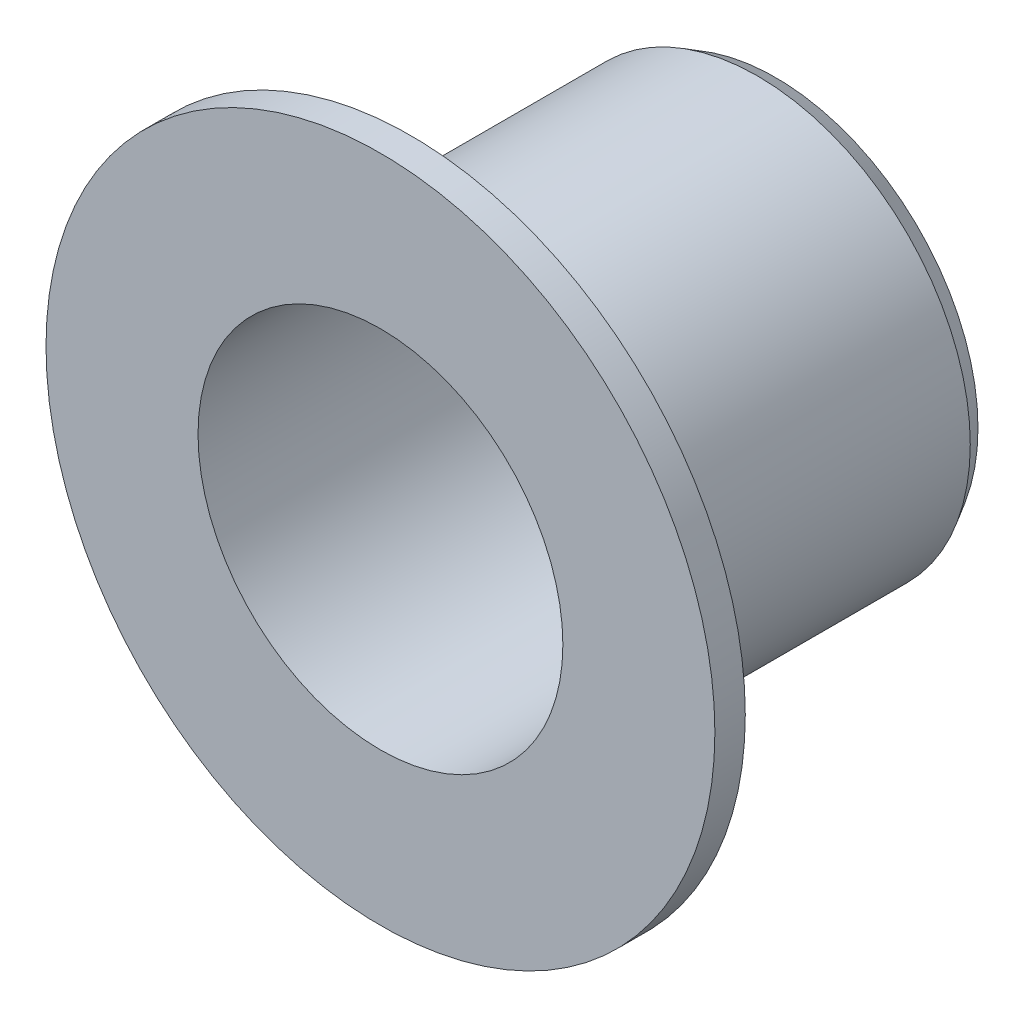
ISO-10303-21;
HEADER;
FILE_DESCRIPTION(('STEP AP214'),'2;1');
FILE_NAME('part.step','',(''),(''),'','','');
FILE_SCHEMA(('AUTOMOTIVE_DESIGN { 1 0 10303 214 1 1 1 1 }'));
ENDSEC;
DATA;
#1=APPLICATION_CONTEXT('core data for automotive mechanical design processes');
#2=APPLICATION_PROTOCOL_DEFINITION('international standard','automotive_design',2000,#1);
#3=PRODUCT_CONTEXT('',#1,'mechanical');
#4=PRODUCT('Part','Part','',(#3));
#5=PRODUCT_RELATED_PRODUCT_CATEGORY('part','',(#4));
#6=PRODUCT_DEFINITION_FORMATION('','',#4);
#7=PRODUCT_DEFINITION_CONTEXT('part definition',#1,'design');
#8=PRODUCT_DEFINITION('design','',#6,#7);
#9=PRODUCT_DEFINITION_SHAPE('','',#8);
#10=(LENGTH_UNIT() NAMED_UNIT(*) SI_UNIT(.MILLI.,.METRE.));
#11=(NAMED_UNIT(*) PLANE_ANGLE_UNIT() SI_UNIT($,.RADIAN.));
#12=(NAMED_UNIT(*) SI_UNIT($,.STERADIAN.) SOLID_ANGLE_UNIT());
#13=UNCERTAINTY_MEASURE_WITH_UNIT(LENGTH_MEASURE(1.E-05),#10,'distance_accuracy_value','');
#14=(GEOMETRIC_REPRESENTATION_CONTEXT(3) GLOBAL_UNCERTAINTY_ASSIGNED_CONTEXT((#13)) GLOBAL_UNIT_ASSIGNED_CONTEXT((#10,
#11,#12)) REPRESENTATION_CONTEXT('',''));
#15=CARTESIAN_POINT('',(0.,0.,0.));
#16=DIRECTION('',(0.,0.,1.));
#17=DIRECTION('',(1.,0.,0.));
#18=AXIS2_PLACEMENT_3D('',#15,#16,#17);
#19=CARTESIAN_POINT('',(0.,0.,5.5));
#20=DIRECTION('',(0.,0.,-1.));
#21=DIRECTION('',(-1.,0.,0.));
#22=AXIS2_PLACEMENT_3D('',#19,#20,#21);
#23=CYLINDRICAL_SURFACE('',#22,3.5);
#24=CARTESIAN_POINT('',(0.,0.,-0.199999999999997));
#25=DIRECTION('',(0.,0.,-1.));
#26=DIRECTION('',(-1.,0.,0.));
#27=AXIS2_PLACEMENT_3D('',#24,#25,#26);
#28=CIRCLE('',#27,3.5);
#29=CARTESIAN_POINT('',(-3.5,0.,-0.199999999999997));
#30=VERTEX_POINT('',#29);
#31=EDGE_CURVE('E10',#30,#30,#28,.F.);
#32=ORIENTED_EDGE('',*,*,#31,.T.);
#33=EDGE_LOOP('',(#32));
#34=FACE_BOUND('',#33,.T.);
#35=CARTESIAN_POINT('',(0.,0.,5.));
#36=DIRECTION('',(0.,0.,1.));
#37=DIRECTION('',(1.,0.,0.));
#38=AXIS2_PLACEMENT_3D('',#35,#36,#37);
#39=CIRCLE('',#38,3.5);
#40=CARTESIAN_POINT('',(3.5,0.,5.));
#41=VERTEX_POINT('',#40);
#42=EDGE_CURVE('E45',#41,#41,#39,.F.);
#43=ORIENTED_EDGE('',*,*,#42,.T.);
#44=EDGE_LOOP('',(#43));
#45=FACE_BOUND('',#44,.T.);
#46=ADVANCED_FACE('F33',(#34,#45),#23,.T.);
#47=CARTESIAN_POINT('',(0.,0.,5.5));
#48=DIRECTION('',(0.,0.,-1.));
#49=DIRECTION('',(-1.,0.,0.));
#50=AXIS2_PLACEMENT_3D('',#47,#48,#49);
#51=CYLINDRICAL_SURFACE('',#50,3.);
#52=CARTESIAN_POINT('',(0.,0.,-0.5));
#53=DIRECTION('',(0.,0.,-1.));
#54=DIRECTION('',(-1.,0.,0.));
#55=AXIS2_PLACEMENT_3D('',#52,#53,#54);
#56=CIRCLE('',#55,3.);
#57=CARTESIAN_POINT('',(-3.,0.,-0.5));
#58=VERTEX_POINT('',#57);
#59=EDGE_CURVE('E54',#58,#58,#56,.T.);
#60=ORIENTED_EDGE('',*,*,#59,.T.);
#61=EDGE_LOOP('',(#60));
#62=FACE_BOUND('',#61,.T.);
#63=CARTESIAN_POINT('',(0.,0.,6.));
#64=DIRECTION('',(0.,0.,1.));
#65=DIRECTION('',(1.,0.,0.));
#66=AXIS2_PLACEMENT_3D('',#63,#64,#65);
#67=CIRCLE('',#66,3.);
#68=CARTESIAN_POINT('',(3.,0.,6.));
#69=VERTEX_POINT('',#68);
#70=EDGE_CURVE('E61',#69,#69,#67,.T.);
#71=ORIENTED_EDGE('',*,*,#70,.T.);
#72=EDGE_LOOP('',(#71));
#73=FACE_BOUND('',#72,.T.);
#74=ADVANCED_FACE('F67',(#62,#73),#51,.F.);
#75=CARTESIAN_POINT('',(0.,0.,-0.5));
#76=DIRECTION('',(0.,0.,-1.));
#77=DIRECTION('',(-1.,0.,0.));
#78=AXIS2_PLACEMENT_3D('',#75,#76,#77);
#79=PLANE('',#78);
#80=CARTESIAN_POINT('',(0.,0.,-0.5));
#81=DIRECTION('',(0.,0.,-1.));
#82=DIRECTION('',(-1.,0.,0.));
#83=AXIS2_PLACEMENT_3D('',#80,#81,#82);
#84=CIRCLE('',#83,3.32679491924311);
#85=CARTESIAN_POINT('',(-3.32679491924311,0.,-0.5));
#86=VERTEX_POINT('',#85);
#87=EDGE_CURVE('E41',#86,#86,#84,.T.);
#88=ORIENTED_EDGE('',*,*,#87,.T.);
#89=EDGE_LOOP('',(#88));
#90=FACE_BOUND('',#89,.T.);
#91=ORIENTED_EDGE('',*,*,#59,.F.);
#92=EDGE_LOOP('',(#91));
#93=FACE_BOUND('',#92,.T.);
#94=ADVANCED_FACE('F72',(#90,#93),#79,.T.);
#95=CARTESIAN_POINT('',(0.,0.,6.));
#96=DIRECTION('',(0.,0.,1.));
#97=DIRECTION('',(1.,0.,0.));
#98=AXIS2_PLACEMENT_3D('',#95,#96,#97);
#99=PLANE('',#98);
#100=CARTESIAN_POINT('',(0.,0.,6.));
#101=DIRECTION('',(0.,0.,1.));
#102=DIRECTION('',(1.,0.,0.));
#103=AXIS2_PLACEMENT_3D('',#100,#101,#102);
#104=CIRCLE('',#103,5.5);
#105=CARTESIAN_POINT('',(5.5,0.,6.));
#106=VERTEX_POINT('',#105);
#107=EDGE_CURVE('E57',#106,#106,#104,.T.);
#108=ORIENTED_EDGE('',*,*,#107,.T.);
#109=EDGE_LOOP('',(#108));
#110=FACE_BOUND('',#109,.T.);
#111=ORIENTED_EDGE('',*,*,#70,.F.);
#112=EDGE_LOOP('',(#111));
#113=FACE_BOUND('',#112,.T.);
#114=ADVANCED_FACE('F69',(#110,#113),#99,.T.);
#115=CARTESIAN_POINT('',(0.,0.,5.5));
#116=DIRECTION('',(0.,0.,1.));
#117=DIRECTION('',(1.,0.,0.));
#118=AXIS2_PLACEMENT_3D('',#115,#116,#117);
#119=PLANE('',#118);
#120=CARTESIAN_POINT('',(0.,0.,5.5));
#121=DIRECTION('',(0.,0.,1.));
#122=DIRECTION('',(1.,0.,0.));
#123=AXIS2_PLACEMENT_3D('',#120,#121,#122);
#124=CIRCLE('',#123,4.);
#125=CARTESIAN_POINT('',(4.,0.,5.5));
#126=VERTEX_POINT('',#125);
#127=EDGE_CURVE('E49',#126,#126,#124,.T.);
#128=ORIENTED_EDGE('',*,*,#127,.T.);
#129=EDGE_LOOP('',(#128));
#130=FACE_BOUND('',#129,.T.);
#131=CARTESIAN_POINT('',(0.,0.,5.5));
#132=DIRECTION('',(0.,0.,1.));
#133=DIRECTION('',(1.,0.,0.));
#134=AXIS2_PLACEMENT_3D('',#131,#132,#133);
#135=CIRCLE('',#134,5.5);
#136=CARTESIAN_POINT('',(5.5,0.,5.5));
#137=VERTEX_POINT('',#136);
#138=EDGE_CURVE('E58',#137,#137,#135,.T.);
#139=ORIENTED_EDGE('',*,*,#138,.F.);
#140=EDGE_LOOP('',(#139));
#141=FACE_BOUND('',#140,.T.);
#142=ADVANCED_FACE('F71',(#130,#141),#119,.F.);
#143=CARTESIAN_POINT('',(0.,0.,6.));
#144=DIRECTION('',(0.,0.,-1.));
#145=DIRECTION('',(-1.,0.,0.));
#146=AXIS2_PLACEMENT_3D('',#143,#144,#145);
#147=CYLINDRICAL_SURFACE('',#146,5.5);
#148=ORIENTED_EDGE('',*,*,#107,.F.);
#149=EDGE_LOOP('',(#148));
#150=FACE_BOUND('',#149,.T.);
#151=ORIENTED_EDGE('',*,*,#138,.T.);
#152=EDGE_LOOP('',(#151));
#153=FACE_BOUND('',#152,.T.);
#154=ADVANCED_FACE('F79',(#150,#153),#147,.T.);
#155=CARTESIAN_POINT('',(0.,0.,5.));
#156=DIRECTION('',(0.,0.,1.));
#157=DIRECTION('',(1.,0.,0.));
#158=AXIS2_PLACEMENT_3D('',#155,#156,#157);
#159=TOROIDAL_SURFACE('',#158,4.,0.5);
#160=ORIENTED_EDGE('',*,*,#42,.F.);
#161=EDGE_LOOP('',(#160));
#162=FACE_BOUND('',#161,.T.);
#163=ORIENTED_EDGE('',*,*,#127,.F.);
#164=EDGE_LOOP('',(#163));
#165=FACE_BOUND('',#164,.T.);
#166=ADVANCED_FACE('F91',(#162,#165),#159,.F.);
#167=CARTESIAN_POINT('',(0.,0.,-0.5));
#168=DIRECTION('',(0.,0.,1.));
#169=DIRECTION('',(1.,0.,0.));
#170=AXIS2_PLACEMENT_3D('',#167,#168,#169);
#171=CONICAL_SURFACE('',#170,3.32679491924311,0.523598775598295);
#172=ORIENTED_EDGE('',*,*,#31,.F.);
#173=EDGE_LOOP('',(#172));
#174=FACE_BOUND('',#173,.T.);
#175=ORIENTED_EDGE('',*,*,#87,.F.);
#176=EDGE_LOOP('',(#175));
#177=FACE_BOUND('',#176,.T.);
#178=ADVANCED_FACE('F36',(#174,#177),#171,.T.);
#179=CLOSED_SHELL('',(#46,#74,#94,#114,#142,#154,#166,#178));
#180=MANIFOLD_SOLID_BREP('B2',#179);
#181=ADVANCED_BREP_SHAPE_REPRESENTATION('',(#18,#180),#14);
#182=SHAPE_DEFINITION_REPRESENTATION(#9,#181);
ENDSEC;
END-ISO-10303-21;
